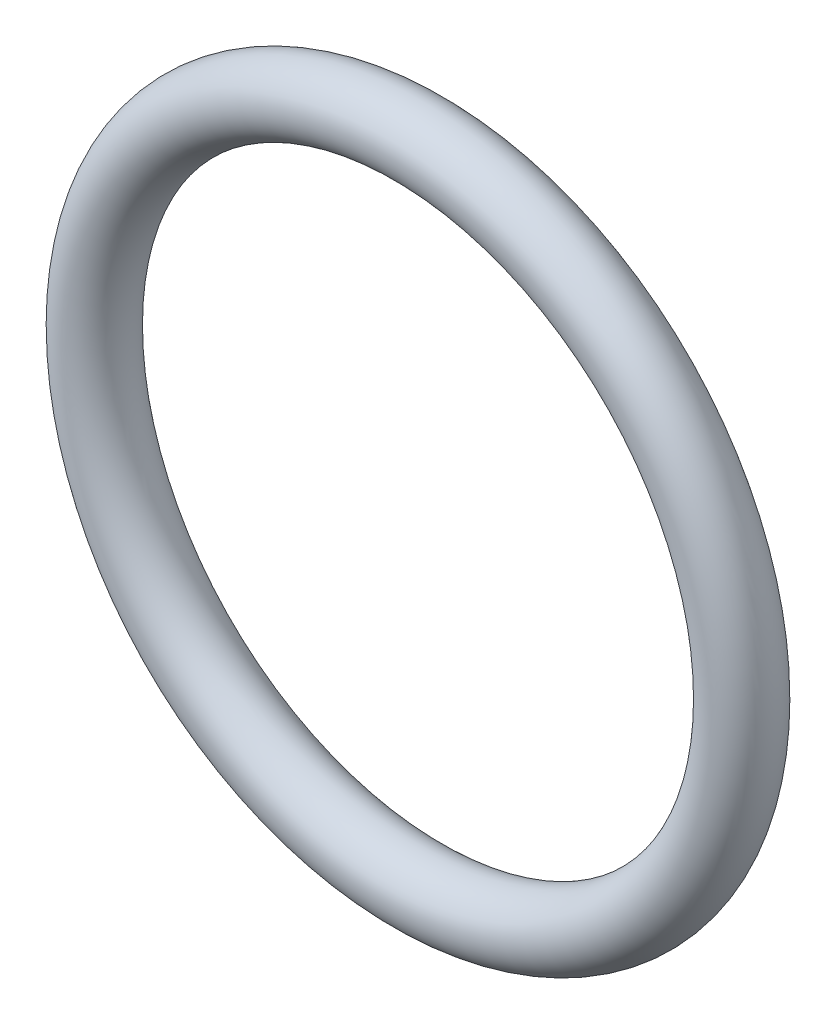
ISO-10303-21;
HEADER;
FILE_DESCRIPTION(('STEP AP214'),'2;1');
FILE_NAME('part.step','',(''),(''),'','','');
FILE_SCHEMA(('AUTOMOTIVE_DESIGN { 1 0 10303 214 1 1 1 1 }'));
ENDSEC;
DATA;
#1=APPLICATION_CONTEXT('core data for automotive mechanical design processes');
#2=APPLICATION_PROTOCOL_DEFINITION('international standard','automotive_design',2000,#1);
#3=PRODUCT_CONTEXT('',#1,'mechanical');
#4=PRODUCT('Part','Part','',(#3));
#5=PRODUCT_RELATED_PRODUCT_CATEGORY('part','',(#4));
#6=PRODUCT_DEFINITION_FORMATION('','',#4);
#7=PRODUCT_DEFINITION_CONTEXT('part definition',#1,'design');
#8=PRODUCT_DEFINITION('design','',#6,#7);
#9=PRODUCT_DEFINITION_SHAPE('','',#8);
#10=(LENGTH_UNIT() NAMED_UNIT(*) SI_UNIT(.MILLI.,.METRE.));
#11=(NAMED_UNIT(*) PLANE_ANGLE_UNIT() SI_UNIT($,.RADIAN.));
#12=(NAMED_UNIT(*) SI_UNIT($,.STERADIAN.) SOLID_ANGLE_UNIT());
#13=UNCERTAINTY_MEASURE_WITH_UNIT(LENGTH_MEASURE(1.E-05),#10,'distance_accuracy_value','');
#14=(GEOMETRIC_REPRESENTATION_CONTEXT(3) GLOBAL_UNCERTAINTY_ASSIGNED_CONTEXT((#13)) GLOBAL_UNIT_ASSIGNED_CONTEXT((#10,
#11,#12)) REPRESENTATION_CONTEXT('',''));
#15=CARTESIAN_POINT('',(0.,0.,0.));
#16=DIRECTION('',(0.,0.,1.));
#17=DIRECTION('',(1.,0.,0.));
#18=AXIS2_PLACEMENT_3D('',#15,#16,#17);
#19=CARTESIAN_POINT('',(0.,0.,0.));
#20=DIRECTION('',(0.,0.,1.));
#21=DIRECTION('',(1.,0.,0.));
#22=AXIS2_PLACEMENT_3D('',#19,#20,#21);
#23=TOROIDAL_SURFACE('',#22,4.75,0.500000000000001);
#24=CARTESIAN_POINT('',(5.25,0.,0.));
#25=VERTEX_POINT('',#24);
#26=VERTEX_LOOP('',#25);
#27=FACE_BOUND('',#26,.T.);
#28=ADVANCED_FACE('F28',(#27),#23,.T.);
#29=CLOSED_SHELL('',(#28));
#30=MANIFOLD_SOLID_BREP('B2',#29);
#31=ADVANCED_BREP_SHAPE_REPRESENTATION('',(#18,#30),#14);
#32=SHAPE_DEFINITION_REPRESENTATION(#9,#31);
ENDSEC;
END-ISO-10303-21;
